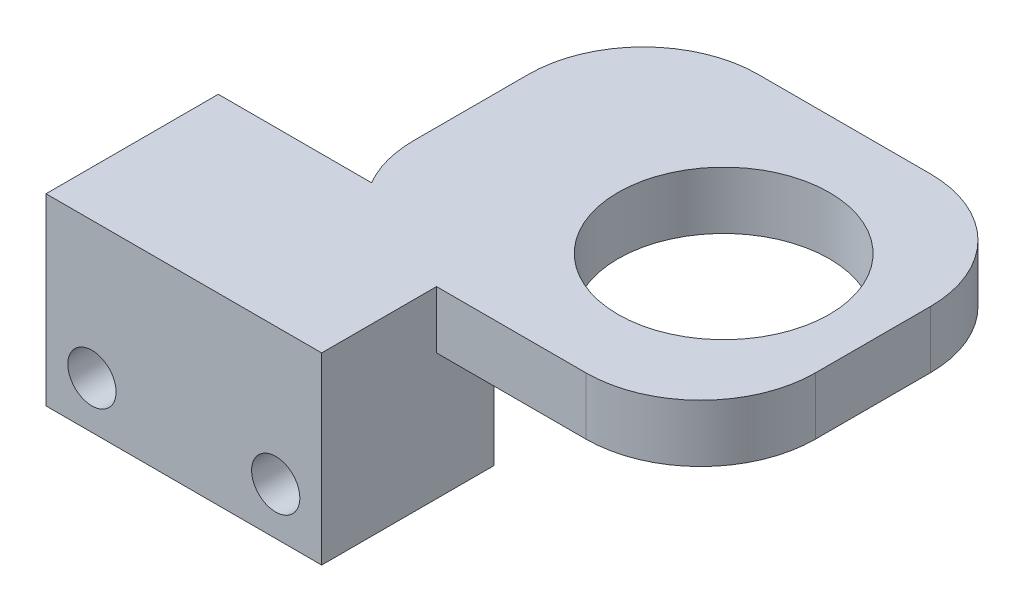
ISO-10303-21;
HEADER;
FILE_DESCRIPTION(('STEP AP214'),'2;1');
FILE_NAME('part.step','',(''),(''),'','','');
FILE_SCHEMA(('AUTOMOTIVE_DESIGN { 1 0 10303 214 1 1 1 1 }'));
ENDSEC;
DATA;
#1=APPLICATION_CONTEXT('core data for automotive mechanical design processes');
#2=APPLICATION_PROTOCOL_DEFINITION('international standard','automotive_design',2000,#1);
#3=PRODUCT_CONTEXT('',#1,'mechanical');
#4=PRODUCT('Part','Part','',(#3));
#5=PRODUCT_RELATED_PRODUCT_CATEGORY('part','',(#4));
#6=PRODUCT_DEFINITION_FORMATION('','',#4);
#7=PRODUCT_DEFINITION_CONTEXT('part definition',#1,'design');
#8=PRODUCT_DEFINITION('design','',#6,#7);
#9=PRODUCT_DEFINITION_SHAPE('','',#8);
#10=(LENGTH_UNIT() NAMED_UNIT(*) SI_UNIT(.MILLI.,.METRE.));
#11=(NAMED_UNIT(*) PLANE_ANGLE_UNIT() SI_UNIT($,.RADIAN.));
#12=(NAMED_UNIT(*) SI_UNIT($,.STERADIAN.) SOLID_ANGLE_UNIT());
#13=UNCERTAINTY_MEASURE_WITH_UNIT(LENGTH_MEASURE(1.E-05),#10,'distance_accuracy_value','');
#14=(GEOMETRIC_REPRESENTATION_CONTEXT(3) GLOBAL_UNCERTAINTY_ASSIGNED_CONTEXT((#13)) GLOBAL_UNIT_ASSIGNED_CONTEXT((#10,
#11,#12)) REPRESENTATION_CONTEXT('',''));
#15=CARTESIAN_POINT('',(0.,0.,0.));
#16=DIRECTION('',(0.,0.,1.));
#17=DIRECTION('',(1.,0.,0.));
#18=AXIS2_PLACEMENT_3D('',#15,#16,#17);
#19=CARTESIAN_POINT('',(0.,0.,5.));
#20=DIRECTION('',(0.,0.,1.));
#21=DIRECTION('',(1.,0.,0.));
#22=AXIS2_PLACEMENT_3D('',#19,#20,#21);
#23=PLANE('',#22);
#24=DIRECTION('',(-1.,0.,0.));
#25=VECTOR('',#24,1.);
#26=CARTESIAN_POINT('',(-7.18660320493972,4.78715083798883,5.));
#27=LINE('',#26,#25);
#28=CARTESIAN_POINT('',(29.8133967950602,4.78715083798883,5.));
#29=VERTEX_POINT('',#28);
#30=CARTESIAN_POINT('',(16.8133967950603,4.78715083798883,5.));
#31=VERTEX_POINT('',#30);
#32=EDGE_CURVE('E50',#29,#31,#27,.T.);
#33=ORIENTED_EDGE('',*,*,#32,.T.);
#34=DIRECTION('',(0.,-1.,0.));
#35=VECTOR('',#34,1.);
#36=CARTESIAN_POINT('',(16.8133967950603,0.,5.));
#37=LINE('',#36,#35);
#38=CARTESIAN_POINT('',(16.8133967950603,-0.212849162011173,5.));
#39=VERTEX_POINT('',#38);
#40=EDGE_CURVE('E163',#31,#39,#37,.T.);
#41=ORIENTED_EDGE('',*,*,#40,.T.);
#42=DIRECTION('',(1.,0.,0.));
#43=VECTOR('',#42,1.);
#44=CARTESIAN_POINT('',(0.,-0.212849162011173,5.));
#45=LINE('',#44,#43);
#46=CARTESIAN_POINT('',(29.8133967950602,-0.212849162011173,5.));
#47=VERTEX_POINT('',#46);
#48=EDGE_CURVE('E184',#39,#47,#45,.T.);
#49=ORIENTED_EDGE('',*,*,#48,.T.);
#50=DIRECTION('',(0.,1.,0.));
#51=VECTOR('',#50,1.);
#52=CARTESIAN_POINT('',(29.8133967950602,-0.212849162011173,5.));
#53=LINE('',#52,#51);
#54=EDGE_CURVE('E223',#47,#29,#53,.T.);
#55=ORIENTED_EDGE('',*,*,#54,.T.);
#56=EDGE_LOOP('',(#33,#41,#49,#55));
#57=FACE_BOUND('',#56,.T.);
#58=ADVANCED_FACE('F35',(#57),#23,.T.);
#59=CARTESIAN_POINT('',(16.8133967950603,4.78715083798883,5.));
#60=DIRECTION('',(-1.,0.,0.));
#61=DIRECTION('',(0.,-1.,0.));
#62=AXIS2_PLACEMENT_3D('',#59,#60,#61);
#63=PLANE('',#62);
#64=DIRECTION('',(0.,0.,-1.));
#65=VECTOR('',#64,1.);
#66=CARTESIAN_POINT('',(16.8133967950603,-0.212849162011173,0.));
#67=LINE('',#66,#65);
#68=CARTESIAN_POINT('',(16.8133967950603,-0.212849162011173,0.));
#69=VERTEX_POINT('',#68);
#70=EDGE_CURVE('E182',#39,#69,#67,.T.);
#71=ORIENTED_EDGE('',*,*,#70,.F.);
#72=ORIENTED_EDGE('',*,*,#40,.F.);
#73=DIRECTION('',(0.,0.,-1.));
#74=VECTOR('',#73,1.);
#75=CARTESIAN_POINT('',(16.8133967950603,4.78715083798883,15.));
#76=LINE('',#75,#74);
#77=CARTESIAN_POINT('',(16.8133967950603,4.78715083798883,15.));
#78=VERTEX_POINT('',#77);
#79=EDGE_CURVE('E160',#78,#31,#76,.T.);
#80=ORIENTED_EDGE('',*,*,#79,.F.);
#81=DIRECTION('',(0.,1.,0.));
#82=VECTOR('',#81,1.);
#83=CARTESIAN_POINT('',(16.8133967950603,4.78715083798883,15.));
#84=LINE('',#83,#82);
#85=CARTESIAN_POINT('',(16.8133967950603,-11.2128491620112,15.));
#86=VERTEX_POINT('',#85);
#87=EDGE_CURVE('E144',#86,#78,#84,.T.);
#88=ORIENTED_EDGE('',*,*,#87,.F.);
#89=DIRECTION('',(0.,0.,-1.));
#90=VECTOR('',#89,1.);
#91=CARTESIAN_POINT('',(16.8133967950603,-11.2128491620112,5.));
#92=LINE('',#91,#90);
#93=CARTESIAN_POINT('',(16.8133967950603,-11.2128491620112,0.));
#94=VERTEX_POINT('',#93);
#95=EDGE_CURVE('E43',#86,#94,#92,.T.);
#96=ORIENTED_EDGE('',*,*,#95,.T.);
#97=DIRECTION('',(0.,1.,0.));
#98=VECTOR('',#97,1.);
#99=CARTESIAN_POINT('',(16.8133967950603,4.78715083798883,0.));
#100=LINE('',#99,#98);
#101=EDGE_CURVE('E243',#94,#69,#100,.T.);
#102=ORIENTED_EDGE('',*,*,#101,.T.);
#103=EDGE_LOOP('',(#71,#72,#80,#88,#96,#102));
#104=FACE_BOUND('',#103,.T.);
#105=ADVANCED_FACE('F250',(#104),#63,.F.);
#106=CARTESIAN_POINT('',(0.,0.,0.));
#107=DIRECTION('',(0.,0.,1.));
#108=DIRECTION('',(1.,0.,0.));
#109=AXIS2_PLACEMENT_3D('',#106,#107,#108);
#110=PLANE('',#109);
#111=CARTESIAN_POINT('',(-3.18660320493972,-7.11284916201117,0.));
#112=DIRECTION('',(0.,0.,1.));
#113=DIRECTION('',(1.,0.,0.));
#114=AXIS2_PLACEMENT_3D('',#111,#112,#113);
#115=CIRCLE('',#114,2.1);
#116=CARTESIAN_POINT('',(-1.08660320493972,-7.11284916201117,0.));
#117=VERTEX_POINT('',#116);
#118=EDGE_CURVE('E234',#117,#117,#115,.T.);
#119=ORIENTED_EDGE('',*,*,#118,.T.);
#120=EDGE_LOOP('',(#119));
#121=FACE_BOUND('',#120,.T.);
#122=DIRECTION('',(-1.,0.,0.));
#123=VECTOR('',#122,1.);
#124=CARTESIAN_POINT('',(-7.18660320493972,4.78715083798883,0.));
#125=LINE('',#124,#123);
#126=CARTESIAN_POINT('',(6.1531427572159,4.78715083798883,0.));
#127=VERTEX_POINT('',#126);
#128=CARTESIAN_POINT('',(-7.18660320493972,4.78715083798883,0.));
#129=VERTEX_POINT('',#128);
#130=EDGE_CURVE('E239',#127,#129,#125,.T.);
#131=ORIENTED_EDGE('',*,*,#130,.F.);
#132=DIRECTION('',(0.,1.,0.));
#133=VECTOR('',#132,1.);
#134=CARTESIAN_POINT('',(6.1531427572159,-0.212849162011173,0.));
#135=LINE('',#134,#133);
#136=CARTESIAN_POINT('',(6.1531427572159,-0.212849162011173,0.));
#137=VERTEX_POINT('',#136);
#138=EDGE_CURVE('E225',#137,#127,#135,.T.);
#139=ORIENTED_EDGE('',*,*,#138,.F.);
#140=DIRECTION('',(-1.,0.,0.));
#141=VECTOR('',#140,1.);
#142=CARTESIAN_POINT('',(0.,-0.212849162011173,0.));
#143=LINE('',#142,#141);
#144=EDGE_CURVE('E180',#69,#137,#143,.T.);
#145=ORIENTED_EDGE('',*,*,#144,.F.);
#146=ORIENTED_EDGE('',*,*,#101,.F.);
#147=DIRECTION('',(1.,0.,0.));
#148=VECTOR('',#147,1.);
#149=CARTESIAN_POINT('',(-7.18660320493972,-11.2128491620112,0.));
#150=LINE('',#149,#148);
#151=CARTESIAN_POINT('',(-7.18660320493972,-11.2128491620112,0.));
#152=VERTEX_POINT('',#151);
#153=EDGE_CURVE('E241',#152,#94,#150,.T.);
#154=ORIENTED_EDGE('',*,*,#153,.F.);
#155=DIRECTION('',(0.,-1.,0.));
#156=VECTOR('',#155,1.);
#157=CARTESIAN_POINT('',(-7.18660320493972,4.78715083798883,0.));
#158=LINE('',#157,#156);
#159=EDGE_CURVE('E136',#129,#152,#158,.T.);
#160=ORIENTED_EDGE('',*,*,#159,.F.);
#161=EDGE_LOOP('',(#131,#139,#145,#146,#154,#160));
#162=FACE_BOUND('',#161,.T.);
#163=CARTESIAN_POINT('',(12.8133967950603,-7.11284916201117,0.));
#164=DIRECTION('',(0.,0.,1.));
#165=DIRECTION('',(1.,0.,0.));
#166=AXIS2_PLACEMENT_3D('',#163,#164,#165);
#167=CIRCLE('',#166,2.1);
#168=CARTESIAN_POINT('',(14.9133967950603,-7.11284916201117,0.));
#169=VERTEX_POINT('',#168);
#170=EDGE_CURVE('E218',#169,#169,#167,.T.);
#171=ORIENTED_EDGE('',*,*,#170,.T.);
#172=EDGE_LOOP('',(#171));
#173=FACE_BOUND('',#172,.T.);
#174=ADVANCED_FACE('F255',(#121,#162,#173),#110,.F.);
#175=CARTESIAN_POINT('',(-7.18660320493972,4.78715083798883,5.));
#176=DIRECTION('',(1.,0.,0.));
#177=DIRECTION('',(0.,1.,0.));
#178=AXIS2_PLACEMENT_3D('',#175,#176,#177);
#179=PLANE('',#178);
#180=ORIENTED_EDGE('',*,*,#159,.T.);
#181=DIRECTION('',(0.,0.,-1.));
#182=VECTOR('',#181,1.);
#183=CARTESIAN_POINT('',(-7.18660320493972,-11.2128491620112,5.));
#184=LINE('',#183,#182);
#185=CARTESIAN_POINT('',(-7.18660320493972,-11.2128491620112,15.));
#186=VERTEX_POINT('',#185);
#187=EDGE_CURVE('E11',#186,#152,#184,.T.);
#188=ORIENTED_EDGE('',*,*,#187,.F.);
#189=DIRECTION('',(0.,-1.,0.));
#190=VECTOR('',#189,1.);
#191=CARTESIAN_POINT('',(-7.18660320493972,4.78715083798883,15.));
#192=LINE('',#191,#190);
#193=CARTESIAN_POINT('',(-7.18660320493972,4.78715083798883,15.));
#194=VERTEX_POINT('',#193);
#195=EDGE_CURVE('E134',#194,#186,#192,.T.);
#196=ORIENTED_EDGE('',*,*,#195,.F.);
#197=DIRECTION('',(0.,0.,-1.));
#198=VECTOR('',#197,1.);
#199=CARTESIAN_POINT('',(-7.18660320493972,4.78715083798883,5.));
#200=LINE('',#199,#198);
#201=EDGE_CURVE('E238',#194,#129,#200,.T.);
#202=ORIENTED_EDGE('',*,*,#201,.T.);
#203=EDGE_LOOP('',(#180,#188,#196,#202));
#204=FACE_BOUND('',#203,.T.);
#205=ADVANCED_FACE('F37',(#204),#179,.F.);
#206=CARTESIAN_POINT('',(-7.18660320493972,-11.2128491620112,5.));
#207=DIRECTION('',(0.,1.,0.));
#208=DIRECTION('',(0.,0.,1.));
#209=AXIS2_PLACEMENT_3D('',#206,#207,#208);
#210=PLANE('',#209);
#211=ORIENTED_EDGE('',*,*,#153,.T.);
#212=ORIENTED_EDGE('',*,*,#95,.F.);
#213=DIRECTION('',(1.,0.,0.));
#214=VECTOR('',#213,1.);
#215=CARTESIAN_POINT('',(-7.18660320493972,-11.2128491620112,15.));
#216=LINE('',#215,#214);
#217=EDGE_CURVE('E139',#186,#86,#216,.T.);
#218=ORIENTED_EDGE('',*,*,#217,.F.);
#219=ORIENTED_EDGE('',*,*,#187,.T.);
#220=EDGE_LOOP('',(#211,#212,#218,#219));
#221=FACE_BOUND('',#220,.T.);
#222=ADVANCED_FACE('F140',(#221),#210,.F.);
#223=CARTESIAN_POINT('',(-7.18660320493972,4.78715083798883,5.));
#224=DIRECTION('',(0.,-1.,0.));
#225=DIRECTION('',(0.,0.,-1.));
#226=AXIS2_PLACEMENT_3D('',#223,#224,#225);
#227=PLANE('',#226);
#228=CARTESIAN_POINT('',(14.8133967950603,4.78715083798883,-5.));
#229=DIRECTION('',(0.,1.,0.));
#230=DIRECTION('',(0.,0.,1.));
#231=AXIS2_PLACEMENT_3D('',#228,#229,#230);
#232=CIRCLE('',#231,10.);
#233=CARTESIAN_POINT('',(4.81339679506028,4.78715083798883,-5.00000000000007));
#234=VERTEX_POINT('',#233);
#235=EDGE_CURVE('E58',#234,#127,#232,.T.);
#236=ORIENTED_EDGE('',*,*,#235,.T.);
#237=ORIENTED_EDGE('',*,*,#130,.T.);
#238=ORIENTED_EDGE('',*,*,#201,.F.);
#239=DIRECTION('',(-1.,0.,0.));
#240=VECTOR('',#239,1.);
#241=CARTESIAN_POINT('',(-7.18660320493972,4.78715083798883,15.));
#242=LINE('',#241,#240);
#243=EDGE_CURVE('E150',#78,#194,#242,.T.);
#244=ORIENTED_EDGE('',*,*,#243,.F.);
#245=ORIENTED_EDGE('',*,*,#79,.T.);
#246=ORIENTED_EDGE('',*,*,#32,.F.);
#247=CARTESIAN_POINT('',(29.8133967950603,4.78715083798883,-5.));
#248=DIRECTION('',(0.,1.,0.));
#249=DIRECTION('',(0.,0.,1.));
#250=AXIS2_PLACEMENT_3D('',#247,#248,#249);
#251=CIRCLE('',#250,10.);
#252=CARTESIAN_POINT('',(39.8133967950603,4.78715083798883,-5.00000000000007));
#253=VERTEX_POINT('',#252);
#254=EDGE_CURVE('E208',#253,#29,#251,.F.);
#255=ORIENTED_EDGE('',*,*,#254,.F.);
#256=DIRECTION('',(0.,0.,-1.));
#257=VECTOR('',#256,1.);
#258=CARTESIAN_POINT('',(39.8133967950603,4.78715083798883,0.));
#259=LINE('',#258,#257);
#260=CARTESIAN_POINT('',(39.8133967950603,4.78715083798883,-14.9999999999999));
#261=VERTEX_POINT('',#260);
#262=EDGE_CURVE('E211',#253,#261,#259,.T.);
#263=ORIENTED_EDGE('',*,*,#262,.T.);
#264=CARTESIAN_POINT('',(29.8133967950603,4.78715083798883,-15.));
#265=DIRECTION('',(0.,1.,0.));
#266=DIRECTION('',(0.,0.,1.));
#267=AXIS2_PLACEMENT_3D('',#264,#265,#266);
#268=CIRCLE('',#267,10.);
#269=CARTESIAN_POINT('',(29.8133967950602,4.78715083798883,-25.));
#270=VERTEX_POINT('',#269);
#271=EDGE_CURVE('E170',#261,#270,#268,.T.);
#272=ORIENTED_EDGE('',*,*,#271,.T.);
#273=DIRECTION('',(1.,0.,0.));
#274=VECTOR('',#273,1.);
#275=CARTESIAN_POINT('',(0.,4.78715083798883,-25.));
#276=LINE('',#275,#274);
#277=CARTESIAN_POINT('',(14.8133967950604,4.78715083798883,-25.));
#278=VERTEX_POINT('',#277);
#279=EDGE_CURVE('E198',#278,#270,#276,.T.);
#280=ORIENTED_EDGE('',*,*,#279,.F.);
#281=CARTESIAN_POINT('',(14.8133967950603,4.78715083798883,-15.));
#282=DIRECTION('',(0.,1.,0.));
#283=DIRECTION('',(0.,0.,1.));
#284=AXIS2_PLACEMENT_3D('',#281,#282,#283);
#285=CIRCLE('',#284,10.);
#286=CARTESIAN_POINT('',(4.81339679506028,4.78715083798883,-14.9999999999999));
#287=VERTEX_POINT('',#286);
#288=EDGE_CURVE('E201',#278,#287,#285,.T.);
#289=ORIENTED_EDGE('',*,*,#288,.T.);
#290=DIRECTION('',(0.,0.,-1.));
#291=VECTOR('',#290,1.);
#292=CARTESIAN_POINT('',(4.81339679506028,4.78715083798883,0.));
#293=LINE('',#292,#291);
#294=EDGE_CURVE('E204',#234,#287,#293,.T.);
#295=ORIENTED_EDGE('',*,*,#294,.F.);
#296=EDGE_LOOP('',(#236,#237,#238,#244,#245,#246,#255,#263,#272,#280,#289,#295));
#297=FACE_BOUND('',#296,.T.);
#298=CARTESIAN_POINT('',(26.8133967950603,4.78715083798883,-10.));
#299=DIRECTION('',(0.,1.,0.));
#300=DIRECTION('',(0.,0.,1.));
#301=AXIS2_PLACEMENT_3D('',#298,#299,#300);
#302=CIRCLE('',#301,9.2);
#303=CARTESIAN_POINT('',(26.8133967950603,4.78715083798883,-0.8));
#304=VERTEX_POINT('',#303);
#305=EDGE_CURVE('E165',#304,#304,#302,.T.);
#306=ORIENTED_EDGE('',*,*,#305,.F.);
#307=EDGE_LOOP('',(#306));
#308=FACE_BOUND('',#307,.T.);
#309=ADVANCED_FACE('F290',(#297,#308),#227,.F.);
#310=CARTESIAN_POINT('',(-3.18660320493972,-7.11284916201117,5.));
#311=DIRECTION('',(0.,0.,-1.));
#312=DIRECTION('',(-1.,0.,0.));
#313=AXIS2_PLACEMENT_3D('',#310,#311,#312);
#314=CYLINDRICAL_SURFACE('',#313,2.1);
#315=ORIENTED_EDGE('',*,*,#118,.F.);
#316=EDGE_LOOP('',(#315));
#317=FACE_BOUND('',#316,.T.);
#318=CARTESIAN_POINT('',(-3.18660320493972,-7.11284916201117,15.));
#319=DIRECTION('',(0.,0.,1.));
#320=DIRECTION('',(1.,0.,0.));
#321=AXIS2_PLACEMENT_3D('',#318,#319,#320);
#322=CIRCLE('',#321,2.1);
#323=CARTESIAN_POINT('',(-1.08660320493972,-7.11284916201117,15.));
#324=VERTEX_POINT('',#323);
#325=EDGE_CURVE('E151',#324,#324,#322,.T.);
#326=ORIENTED_EDGE('',*,*,#325,.T.);
#327=EDGE_LOOP('',(#326));
#328=FACE_BOUND('',#327,.T.);
#329=ADVANCED_FACE('F293',(#317,#328),#314,.F.);
#330=CARTESIAN_POINT('',(12.8133967950603,-7.11284916201117,5.));
#331=DIRECTION('',(0.,0.,-1.));
#332=DIRECTION('',(-1.,0.,0.));
#333=AXIS2_PLACEMENT_3D('',#330,#331,#332);
#334=CYLINDRICAL_SURFACE('',#333,2.1);
#335=ORIENTED_EDGE('',*,*,#170,.F.);
#336=EDGE_LOOP('',(#335));
#337=FACE_BOUND('',#336,.T.);
#338=CARTESIAN_POINT('',(12.8133967950603,-7.11284916201117,15.));
#339=DIRECTION('',(0.,0.,1.));
#340=DIRECTION('',(1.,0.,0.));
#341=AXIS2_PLACEMENT_3D('',#338,#339,#340);
#342=CIRCLE('',#341,2.1);
#343=CARTESIAN_POINT('',(14.9133967950603,-7.11284916201117,15.));
#344=VERTEX_POINT('',#343);
#345=EDGE_CURVE('E154',#344,#344,#342,.T.);
#346=ORIENTED_EDGE('',*,*,#345,.T.);
#347=EDGE_LOOP('',(#346));
#348=FACE_BOUND('',#347,.T.);
#349=ADVANCED_FACE('F398',(#337,#348),#334,.F.);
#350=CARTESIAN_POINT('',(0.,-0.212849162011173,-25.));
#351=DIRECTION('',(0.,0.,1.));
#352=DIRECTION('',(1.,0.,0.));
#353=AXIS2_PLACEMENT_3D('',#350,#351,#352);
#354=PLANE('',#353);
#355=ORIENTED_EDGE('',*,*,#279,.T.);
#356=DIRECTION('',(0.,1.,0.));
#357=VECTOR('',#356,1.);
#358=CARTESIAN_POINT('',(29.8133967950602,-0.212849162011173,-25.));
#359=LINE('',#358,#357);
#360=CARTESIAN_POINT('',(29.8133967950602,-0.212849162011173,-25.));
#361=VERTEX_POINT('',#360);
#362=EDGE_CURVE('E216',#361,#270,#359,.T.);
#363=ORIENTED_EDGE('',*,*,#362,.F.);
#364=DIRECTION('',(1.,0.,0.));
#365=VECTOR('',#364,1.);
#366=CARTESIAN_POINT('',(0.,-0.212849162011173,-25.));
#367=LINE('',#366,#365);
#368=CARTESIAN_POINT('',(14.8133967950604,-0.212849162011173,-25.));
#369=VERTEX_POINT('',#368);
#370=EDGE_CURVE('E169',#369,#361,#367,.T.);
#371=ORIENTED_EDGE('',*,*,#370,.F.);
#372=DIRECTION('',(0.,1.,0.));
#373=VECTOR('',#372,1.);
#374=CARTESIAN_POINT('',(14.8133967950604,-0.212849162011173,-25.));
#375=LINE('',#374,#373);
#376=EDGE_CURVE('E195',#369,#278,#375,.T.);
#377=ORIENTED_EDGE('',*,*,#376,.T.);
#378=EDGE_LOOP('',(#355,#363,#371,#377));
#379=FACE_BOUND('',#378,.T.);
#380=ADVANCED_FACE('F277',(#379),#354,.F.);
#381=CARTESIAN_POINT('',(29.8133967950603,-0.212849162011173,-15.));
#382=DIRECTION('',(0.,1.,0.));
#383=DIRECTION('',(0.,0.,1.));
#384=AXIS2_PLACEMENT_3D('',#381,#382,#383);
#385=CYLINDRICAL_SURFACE('',#384,10.);
#386=ORIENTED_EDGE('',*,*,#271,.F.);
#387=DIRECTION('',(0.,1.,0.));
#388=VECTOR('',#387,1.);
#389=CARTESIAN_POINT('',(39.8133967950603,-0.212849162011173,-14.9999999999999));
#390=LINE('',#389,#388);
#391=CARTESIAN_POINT('',(39.8133967950603,-0.212849162011173,-14.9999999999999));
#392=VERTEX_POINT('',#391);
#393=EDGE_CURVE('E219',#392,#261,#390,.T.);
#394=ORIENTED_EDGE('',*,*,#393,.F.);
#395=CARTESIAN_POINT('',(29.8133967950603,-0.212849162011173,-15.));
#396=DIRECTION('',(0.,1.,0.));
#397=DIRECTION('',(0.,0.,1.));
#398=AXIS2_PLACEMENT_3D('',#395,#396,#397);
#399=CIRCLE('',#398,10.);
#400=EDGE_CURVE('E192',#392,#361,#399,.T.);
#401=ORIENTED_EDGE('',*,*,#400,.T.);
#402=ORIENTED_EDGE('',*,*,#362,.T.);
#403=EDGE_LOOP('',(#386,#394,#401,#402));
#404=FACE_BOUND('',#403,.T.);
#405=ADVANCED_FACE('F280',(#404),#385,.T.);
#406=CARTESIAN_POINT('',(39.8133967950603,-0.212849162011173,0.));
#407=DIRECTION('',(1.,0.,0.));
#408=DIRECTION('',(0.,0.,-1.));
#409=AXIS2_PLACEMENT_3D('',#406,#407,#408);
#410=PLANE('',#409);
#411=ORIENTED_EDGE('',*,*,#262,.F.);
#412=DIRECTION('',(0.,1.,0.));
#413=VECTOR('',#412,1.);
#414=CARTESIAN_POINT('',(39.8133967950603,-0.212849162011173,-5.00000000000007));
#415=LINE('',#414,#413);
#416=CARTESIAN_POINT('',(39.8133967950603,-0.212849162011173,-5.00000000000007));
#417=VERTEX_POINT('',#416);
#418=EDGE_CURVE('E221',#417,#253,#415,.T.);
#419=ORIENTED_EDGE('',*,*,#418,.F.);
#420=DIRECTION('',(0.,0.,-1.));
#421=VECTOR('',#420,1.);
#422=CARTESIAN_POINT('',(39.8133967950603,-0.212849162011173,0.));
#423=LINE('',#422,#421);
#424=EDGE_CURVE('E189',#417,#392,#423,.T.);
#425=ORIENTED_EDGE('',*,*,#424,.T.);
#426=ORIENTED_EDGE('',*,*,#393,.T.);
#427=EDGE_LOOP('',(#411,#419,#425,#426));
#428=FACE_BOUND('',#427,.T.);
#429=ADVANCED_FACE('F286',(#428),#410,.T.);
#430=CARTESIAN_POINT('',(29.8133967950603,-0.212849162011173,-5.));
#431=DIRECTION('',(0.,1.,0.));
#432=DIRECTION('',(0.,0.,1.));
#433=AXIS2_PLACEMENT_3D('',#430,#431,#432);
#434=CYLINDRICAL_SURFACE('',#433,10.);
#435=ORIENTED_EDGE('',*,*,#254,.T.);
#436=ORIENTED_EDGE('',*,*,#54,.F.);
#437=CARTESIAN_POINT('',(29.8133967950603,-0.212849162011173,-5.));
#438=DIRECTION('',(0.,1.,0.));
#439=DIRECTION('',(0.,0.,1.));
#440=AXIS2_PLACEMENT_3D('',#437,#438,#439);
#441=CIRCLE('',#440,10.);
#442=EDGE_CURVE('E187',#417,#47,#441,.F.);
#443=ORIENTED_EDGE('',*,*,#442,.F.);
#444=ORIENTED_EDGE('',*,*,#418,.T.);
#445=EDGE_LOOP('',(#435,#436,#443,#444));
#446=FACE_BOUND('',#445,.T.);
#447=ADVANCED_FACE('F289',(#446),#434,.T.);
#448=CARTESIAN_POINT('',(14.8133967950603,-0.212849162011173,-5.));
#449=DIRECTION('',(0.,1.,0.));
#450=DIRECTION('',(0.,0.,1.));
#451=AXIS2_PLACEMENT_3D('',#448,#449,#450);
#452=CYLINDRICAL_SURFACE('',#451,10.);
#453=ORIENTED_EDGE('',*,*,#235,.F.);
#454=DIRECTION('',(0.,1.,0.));
#455=VECTOR('',#454,1.);
#456=CARTESIAN_POINT('',(4.81339679506028,-0.212849162011173,-5.00000000000007));
#457=LINE('',#456,#455);
#458=CARTESIAN_POINT('',(4.81339679506028,-0.212849162011173,-5.00000000000007));
#459=VERTEX_POINT('',#458);
#460=EDGE_CURVE('E227',#459,#234,#457,.T.);
#461=ORIENTED_EDGE('',*,*,#460,.F.);
#462=CARTESIAN_POINT('',(14.8133967950603,-0.212849162011173,-5.));
#463=DIRECTION('',(0.,1.,0.));
#464=DIRECTION('',(0.,0.,1.));
#465=AXIS2_PLACEMENT_3D('',#462,#463,#464);
#466=CIRCLE('',#465,10.);
#467=EDGE_CURVE('E177',#459,#137,#466,.T.);
#468=ORIENTED_EDGE('',*,*,#467,.T.);
#469=ORIENTED_EDGE('',*,*,#138,.T.);
#470=EDGE_LOOP('',(#453,#461,#468,#469));
#471=FACE_BOUND('',#470,.T.);
#472=ADVANCED_FACE('F263',(#471),#452,.T.);
#473=CARTESIAN_POINT('',(4.81339679506028,-0.212849162011173,0.));
#474=DIRECTION('',(1.,0.,0.));
#475=DIRECTION('',(0.,0.,-1.));
#476=AXIS2_PLACEMENT_3D('',#473,#474,#475);
#477=PLANE('',#476);
#478=ORIENTED_EDGE('',*,*,#294,.T.);
#479=DIRECTION('',(0.,1.,0.));
#480=VECTOR('',#479,1.);
#481=CARTESIAN_POINT('',(4.81339679506028,-0.212849162011173,-14.9999999999999));
#482=LINE('',#481,#480);
#483=CARTESIAN_POINT('',(4.81339679506028,-0.212849162011173,-14.9999999999999));
#484=VERTEX_POINT('',#483);
#485=EDGE_CURVE('E229',#484,#287,#482,.T.);
#486=ORIENTED_EDGE('',*,*,#485,.F.);
#487=DIRECTION('',(0.,0.,-1.));
#488=VECTOR('',#487,1.);
#489=CARTESIAN_POINT('',(4.81339679506028,-0.212849162011173,0.));
#490=LINE('',#489,#488);
#491=EDGE_CURVE('E175',#459,#484,#490,.T.);
#492=ORIENTED_EDGE('',*,*,#491,.F.);
#493=ORIENTED_EDGE('',*,*,#460,.T.);
#494=EDGE_LOOP('',(#478,#486,#492,#493));
#495=FACE_BOUND('',#494,.T.);
#496=ADVANCED_FACE('F267',(#495),#477,.F.);
#497=CARTESIAN_POINT('',(26.8133967950603,-0.212849162011173,-10.));
#498=DIRECTION('',(0.,1.,0.));
#499=DIRECTION('',(0.,0.,1.));
#500=AXIS2_PLACEMENT_3D('',#497,#498,#499);
#501=CYLINDRICAL_SURFACE('',#500,9.2);
#502=CARTESIAN_POINT('',(26.8133967950603,-0.212849162011173,-10.));
#503=DIRECTION('',(0.,1.,0.));
#504=DIRECTION('',(0.,0.,1.));
#505=AXIS2_PLACEMENT_3D('',#502,#503,#504);
#506=CIRCLE('',#505,9.2);
#507=CARTESIAN_POINT('',(26.8133967950603,-0.212849162011173,-0.8));
#508=VERTEX_POINT('',#507);
#509=EDGE_CURVE('E166',#508,#508,#506,.T.);
#510=ORIENTED_EDGE('',*,*,#509,.F.);
#511=EDGE_LOOP('',(#510));
#512=FACE_BOUND('',#511,.T.);
#513=ORIENTED_EDGE('',*,*,#305,.T.);
#514=EDGE_LOOP('',(#513));
#515=FACE_BOUND('',#514,.T.);
#516=ADVANCED_FACE('F297',(#512,#515),#501,.F.);
#517=CARTESIAN_POINT('',(14.8133967950603,-0.212849162011173,-15.));
#518=DIRECTION('',(0.,1.,0.));
#519=DIRECTION('',(0.,0.,1.));
#520=AXIS2_PLACEMENT_3D('',#517,#518,#519);
#521=CYLINDRICAL_SURFACE('',#520,10.);
#522=ORIENTED_EDGE('',*,*,#288,.F.);
#523=ORIENTED_EDGE('',*,*,#376,.F.);
#524=CARTESIAN_POINT('',(14.8133967950603,-0.212849162011173,-15.));
#525=DIRECTION('',(0.,1.,0.));
#526=DIRECTION('',(0.,0.,1.));
#527=AXIS2_PLACEMENT_3D('',#524,#525,#526);
#528=CIRCLE('',#527,10.);
#529=EDGE_CURVE('E172',#369,#484,#528,.T.);
#530=ORIENTED_EDGE('',*,*,#529,.T.);
#531=ORIENTED_EDGE('',*,*,#485,.T.);
#532=EDGE_LOOP('',(#522,#523,#530,#531));
#533=FACE_BOUND('',#532,.T.);
#534=ADVANCED_FACE('F274',(#533),#521,.T.);
#535=CARTESIAN_POINT('',(0.,-0.212849162011173,0.));
#536=DIRECTION('',(0.,1.,0.));
#537=DIRECTION('',(0.,0.,1.));
#538=AXIS2_PLACEMENT_3D('',#535,#536,#537);
#539=PLANE('',#538);
#540=ORIENTED_EDGE('',*,*,#509,.T.);
#541=EDGE_LOOP('',(#540));
#542=FACE_BOUND('',#541,.T.);
#543=ORIENTED_EDGE('',*,*,#370,.T.);
#544=ORIENTED_EDGE('',*,*,#400,.F.);
#545=ORIENTED_EDGE('',*,*,#424,.F.);
#546=ORIENTED_EDGE('',*,*,#442,.T.);
#547=ORIENTED_EDGE('',*,*,#48,.F.);
#548=ORIENTED_EDGE('',*,*,#70,.T.);
#549=ORIENTED_EDGE('',*,*,#144,.T.);
#550=ORIENTED_EDGE('',*,*,#467,.F.);
#551=ORIENTED_EDGE('',*,*,#491,.T.);
#552=ORIENTED_EDGE('',*,*,#529,.F.);
#553=EDGE_LOOP('',(#543,#544,#545,#546,#547,#548,#549,#550,#551,#552));
#554=FACE_BOUND('',#553,.T.);
#555=ADVANCED_FACE('F260',(#542,#554),#539,.F.);
#556=CARTESIAN_POINT('',(0.,0.,15.));
#557=DIRECTION('',(0.,0.,1.));
#558=DIRECTION('',(1.,0.,0.));
#559=AXIS2_PLACEMENT_3D('',#556,#557,#558);
#560=PLANE('',#559);
#561=ORIENTED_EDGE('',*,*,#325,.F.);
#562=EDGE_LOOP('',(#561));
#563=FACE_BOUND('',#562,.T.);
#564=ORIENTED_EDGE('',*,*,#195,.T.);
#565=ORIENTED_EDGE('',*,*,#217,.T.);
#566=ORIENTED_EDGE('',*,*,#87,.T.);
#567=ORIENTED_EDGE('',*,*,#243,.T.);
#568=EDGE_LOOP('',(#564,#565,#566,#567));
#569=FACE_BOUND('',#568,.T.);
#570=ORIENTED_EDGE('',*,*,#345,.F.);
#571=EDGE_LOOP('',(#570));
#572=FACE_BOUND('',#571,.T.);
#573=ADVANCED_FACE('F147',(#563,#569,#572),#560,.T.);
#574=CLOSED_SHELL('',(#58,#105,#174,#205,#222,#309,#329,#349,#380,#405,#429,#447,#472,#496,#516,
#534,#555,#573));
#575=MANIFOLD_SOLID_BREP('B2',#574);
#576=ADVANCED_BREP_SHAPE_REPRESENTATION('',(#18,#575),#14);
#577=SHAPE_DEFINITION_REPRESENTATION(#9,#576);
ENDSEC;
END-ISO-10303-21;
